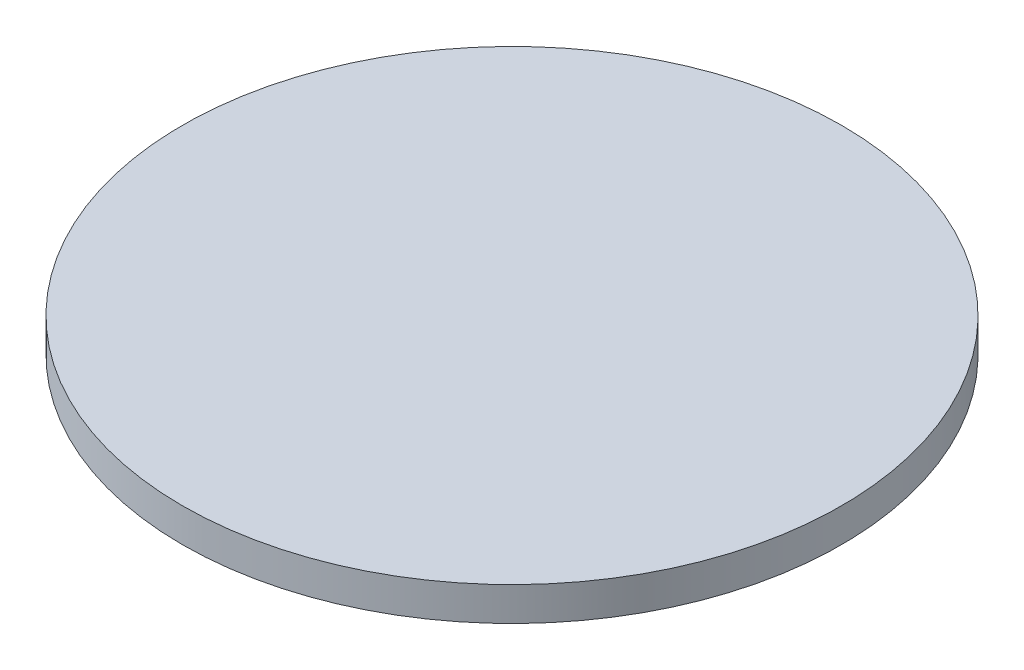
ISO-10303-21;
HEADER;
FILE_DESCRIPTION(('STEP AP214'),'2;1');
FILE_NAME('part.step','',(''),(''),'','','');
FILE_SCHEMA(('AUTOMOTIVE_DESIGN { 1 0 10303 214 1 1 1 1 }'));
ENDSEC;
DATA;
#1=APPLICATION_CONTEXT('core data for automotive mechanical design processes');
#2=APPLICATION_PROTOCOL_DEFINITION('international standard','automotive_design',2000,#1);
#3=PRODUCT_CONTEXT('',#1,'mechanical');
#4=PRODUCT('Part','Part','',(#3));
#5=PRODUCT_RELATED_PRODUCT_CATEGORY('part','',(#4));
#6=PRODUCT_DEFINITION_FORMATION('','',#4);
#7=PRODUCT_DEFINITION_CONTEXT('part definition',#1,'design');
#8=PRODUCT_DEFINITION('design','',#6,#7);
#9=PRODUCT_DEFINITION_SHAPE('','',#8);
#10=(LENGTH_UNIT() NAMED_UNIT(*) SI_UNIT(.MILLI.,.METRE.));
#11=(NAMED_UNIT(*) PLANE_ANGLE_UNIT() SI_UNIT($,.RADIAN.));
#12=(NAMED_UNIT(*) SI_UNIT($,.STERADIAN.) SOLID_ANGLE_UNIT());
#13=UNCERTAINTY_MEASURE_WITH_UNIT(LENGTH_MEASURE(1.E-05),#10,'distance_accuracy_value','');
#14=(GEOMETRIC_REPRESENTATION_CONTEXT(3) GLOBAL_UNCERTAINTY_ASSIGNED_CONTEXT((#13)) GLOBAL_UNIT_ASSIGNED_CONTEXT((#10,
#11,#12)) REPRESENTATION_CONTEXT('',''));
#15=CARTESIAN_POINT('',(0.,0.,0.));
#16=DIRECTION('',(0.,0.,1.));
#17=DIRECTION('',(1.,0.,0.));
#18=AXIS2_PLACEMENT_3D('',#15,#16,#17);
#19=CARTESIAN_POINT('',(0.,2.2,0.));
#20=DIRECTION('',(0.,-1.,0.));
#21=DIRECTION('',(0.,0.,-1.));
#22=AXIS2_PLACEMENT_3D('',#19,#20,#21);
#23=CYLINDRICAL_SURFACE('',#22,21.5);
#24=CARTESIAN_POINT('',(0.,2.2,0.));
#25=DIRECTION('',(0.,1.,0.));
#26=DIRECTION('',(0.,0.,1.));
#27=AXIS2_PLACEMENT_3D('',#24,#25,#26);
#28=CIRCLE('',#27,21.5);
#29=CARTESIAN_POINT('',(0.,2.2,21.5));
#30=VERTEX_POINT('',#29);
#31=EDGE_CURVE('E10',#30,#30,#28,.T.);
#32=ORIENTED_EDGE('',*,*,#31,.F.);
#33=EDGE_LOOP('',(#32));
#34=FACE_BOUND('',#33,.T.);
#35=CARTESIAN_POINT('',(0.,0.,0.));
#36=DIRECTION('',(0.,1.,0.));
#37=DIRECTION('',(0.,0.,1.));
#38=AXIS2_PLACEMENT_3D('',#35,#36,#37);
#39=CIRCLE('',#38,21.5);
#40=CARTESIAN_POINT('',(0.,0.,21.5));
#41=VERTEX_POINT('',#40);
#42=EDGE_CURVE('E34',#41,#41,#39,.T.);
#43=ORIENTED_EDGE('',*,*,#42,.T.);
#44=EDGE_LOOP('',(#43));
#45=FACE_BOUND('',#44,.T.);
#46=ADVANCED_FACE('F31',(#34,#45),#23,.T.);
#47=CARTESIAN_POINT('',(0.,2.2,0.));
#48=DIRECTION('',(0.,1.,0.));
#49=DIRECTION('',(0.,0.,1.));
#50=AXIS2_PLACEMENT_3D('',#47,#48,#49);
#51=PLANE('',#50);
#52=ORIENTED_EDGE('',*,*,#31,.T.);
#53=EDGE_LOOP('',(#52));
#54=FACE_BOUND('',#53,.T.);
#55=ADVANCED_FACE('F46',(#54),#51,.T.);
#56=CARTESIAN_POINT('',(0.,0.,0.));
#57=DIRECTION('',(0.,1.,0.));
#58=DIRECTION('',(0.,0.,1.));
#59=AXIS2_PLACEMENT_3D('',#56,#57,#58);
#60=PLANE('',#59);
#61=ORIENTED_EDGE('',*,*,#42,.F.);
#62=EDGE_LOOP('',(#61));
#63=FACE_BOUND('',#62,.T.);
#64=ADVANCED_FACE('F44',(#63),#60,.F.);
#65=CLOSED_SHELL('',(#46,#55,#64));
#66=MANIFOLD_SOLID_BREP('B2',#65);
#67=ADVANCED_BREP_SHAPE_REPRESENTATION('',(#18,#66),#14);
#68=SHAPE_DEFINITION_REPRESENTATION(#9,#67);
ENDSEC;
END-ISO-10303-21;
